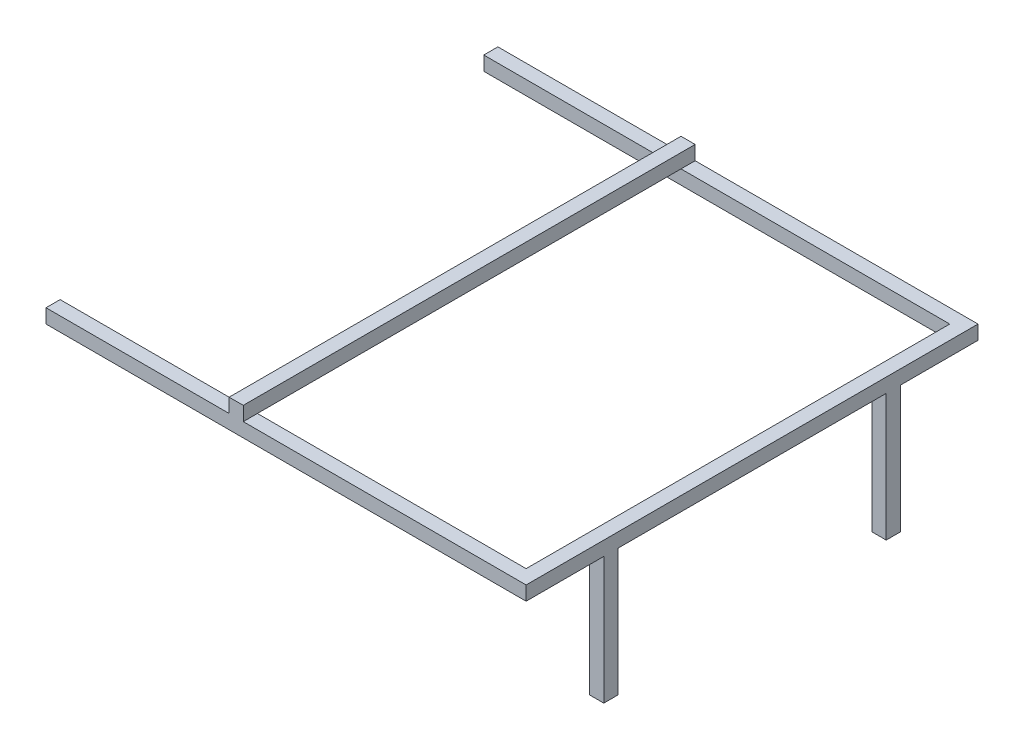
ISO-10303-21;
HEADER;
FILE_DESCRIPTION(('STEP AP214'),'2;1');
FILE_NAME('part.step','',(''),(''),'','','');
FILE_SCHEMA(('AUTOMOTIVE_DESIGN { 1 0 10303 214 1 1 1 1 }'));
ENDSEC;
DATA;
#1=APPLICATION_CONTEXT('core data for automotive mechanical design processes');
#2=APPLICATION_PROTOCOL_DEFINITION('international standard','automotive_design',2000,#1);
#3=PRODUCT_CONTEXT('',#1,'mechanical');
#4=PRODUCT('Part','Part','',(#3));
#5=PRODUCT_RELATED_PRODUCT_CATEGORY('part','',(#4));
#6=PRODUCT_DEFINITION_FORMATION('','',#4);
#7=PRODUCT_DEFINITION_CONTEXT('part definition',#1,'design');
#8=PRODUCT_DEFINITION('design','',#6,#7);
#9=PRODUCT_DEFINITION_SHAPE('','',#8);
#10=(LENGTH_UNIT() NAMED_UNIT(*) SI_UNIT(.MILLI.,.METRE.));
#11=(NAMED_UNIT(*) PLANE_ANGLE_UNIT() SI_UNIT($,.RADIAN.));
#12=(NAMED_UNIT(*) SI_UNIT($,.STERADIAN.) SOLID_ANGLE_UNIT());
#13=UNCERTAINTY_MEASURE_WITH_UNIT(LENGTH_MEASURE(1.E-05),#10,'distance_accuracy_value','');
#14=(GEOMETRIC_REPRESENTATION_CONTEXT(3) GLOBAL_UNCERTAINTY_ASSIGNED_CONTEXT((#13)) GLOBAL_UNIT_ASSIGNED_CONTEXT((#10,
#11,#12)) REPRESENTATION_CONTEXT('',''));
#15=CARTESIAN_POINT('',(0.,0.,0.));
#16=DIRECTION('',(0.,0.,1.));
#17=DIRECTION('',(1.,0.,0.));
#18=AXIS2_PLACEMENT_3D('',#15,#16,#17);
#19=CARTESIAN_POINT('',(0.,0.,0.));
#20=DIRECTION('',(0.,1.,0.));
#21=DIRECTION('',(0.,0.,1.));
#22=AXIS2_PLACEMENT_3D('',#19,#20,#21);
#23=PLANE('',#22);
#24=DIRECTION('',(-1.,0.,0.));
#25=VECTOR('',#24,1.);
#26=CARTESIAN_POINT('',(350.612129760226,0.,-17.9050493653034));
#27=LINE('',#26,#25);
#28=CARTESIAN_POINT('',(350.612129760226,0.,-17.9050493653033));
#29=VERTEX_POINT('',#28);
#30=CARTESIAN_POINT('',(330.612129760226,0.,-17.9050493653033));
#31=VERTEX_POINT('',#30);
#32=EDGE_CURVE('E65',#29,#31,#27,.T.);
#33=ORIENTED_EDGE('',*,*,#32,.F.);
#34=DIRECTION('',(0.,0.,-1.));
#35=VECTOR('',#34,1.);
#36=CARTESIAN_POINT('',(350.612129760226,0.,-147.905049365303));
#37=LINE('',#36,#35);
#38=CARTESIAN_POINT('',(350.612129760226,0.,362.094950634694));
#39=VERTEX_POINT('',#38);
#40=EDGE_CURVE('E216',#39,#29,#37,.T.);
#41=ORIENTED_EDGE('',*,*,#40,.F.);
#42=DIRECTION('',(1.,0.,0.));
#43=VECTOR('',#42,1.);
#44=CARTESIAN_POINT('',(350.612129760226,0.,362.094950634694));
#45=LINE('',#44,#43);
#46=CARTESIAN_POINT('',(330.612129760226,0.,362.094950634694));
#47=VERTEX_POINT('',#46);
#48=EDGE_CURVE('E220',#47,#39,#45,.T.);
#49=ORIENTED_EDGE('',*,*,#48,.F.);
#50=DIRECTION('',(0.,0.,-1.));
#51=VECTOR('',#50,1.);
#52=CARTESIAN_POINT('',(330.612129760226,0.,-127.905049365303));
#53=LINE('',#52,#51);
#54=EDGE_CURVE('E293',#47,#31,#53,.T.);
#55=ORIENTED_EDGE('',*,*,#54,.T.);
#56=EDGE_LOOP('',(#33,#41,#49,#55));
#57=FACE_BOUND('',#56,.T.);
#58=ADVANCED_FACE('F39',(#57),#23,.F.);
#59=DIRECTION('',(1.,0.,0.));
#60=VECTOR('',#59,1.);
#61=CARTESIAN_POINT('',(350.612129760226,0.,-37.9050493653034));
#62=LINE('',#61,#60);
#63=CARTESIAN_POINT('',(330.612129760226,0.,-37.9050493653034));
#64=VERTEX_POINT('',#63);
#65=CARTESIAN_POINT('',(350.612129760226,0.,-37.9050493653034));
#66=VERTEX_POINT('',#65);
#67=EDGE_CURVE('E211',#64,#66,#62,.T.);
#68=ORIENTED_EDGE('',*,*,#67,.F.);
#69=CARTESIAN_POINT('',(330.612129760226,0.,-127.905049365303));
#70=VERTEX_POINT('',#69);
#71=EDGE_CURVE('E282',#64,#70,#53,.T.);
#72=ORIENTED_EDGE('',*,*,#71,.T.);
#73=DIRECTION('',(1.,0.,0.));
#74=VECTOR('',#73,1.);
#75=CARTESIAN_POINT('',(-329.387870239774,0.,-127.905049365303));
#76=LINE('',#75,#74);
#77=CARTESIAN_POINT('',(-329.387870239774,0.,-127.905049365303));
#78=VERTEX_POINT('',#77);
#79=EDGE_CURVE('E322',#78,#70,#76,.T.);
#80=ORIENTED_EDGE('',*,*,#79,.F.);
#81=DIRECTION('',(0.,0.,1.));
#82=VECTOR('',#81,1.);
#83=CARTESIAN_POINT('',(-329.387870239774,0.,-147.905049365303));
#84=LINE('',#83,#82);
#85=CARTESIAN_POINT('',(-329.387870239774,0.,-147.905049365303));
#86=VERTEX_POINT('',#85);
#87=EDGE_CURVE('E299',#86,#78,#84,.T.);
#88=ORIENTED_EDGE('',*,*,#87,.F.);
#89=DIRECTION('',(-1.,0.,0.));
#90=VECTOR('',#89,1.);
#91=CARTESIAN_POINT('',(-329.387870239774,0.,-147.905049365303));
#92=LINE('',#91,#90);
#93=CARTESIAN_POINT('',(350.612129760226,0.,-147.905049365303));
#94=VERTEX_POINT('',#93);
#95=EDGE_CURVE('E304',#94,#86,#92,.T.);
#96=ORIENTED_EDGE('',*,*,#95,.F.);
#97=EDGE_CURVE('E57',#66,#94,#37,.T.);
#98=ORIENTED_EDGE('',*,*,#97,.F.);
#99=EDGE_LOOP('',(#68,#72,#80,#88,#96,#98));
#100=FACE_BOUND('',#99,.T.);
#101=ADVANCED_FACE('F424',(#100),#23,.F.);
#102=DIRECTION('',(-1.,0.,0.));
#103=VECTOR('',#102,1.);
#104=CARTESIAN_POINT('',(350.612129760226,0.,382.094950634694));
#105=LINE('',#104,#103);
#106=CARTESIAN_POINT('',(350.612129760226,0.,382.094950634694));
#107=VERTEX_POINT('',#106);
#108=CARTESIAN_POINT('',(330.612129760226,0.,382.094950634694));
#109=VERTEX_POINT('',#108);
#110=EDGE_CURVE('E217',#107,#109,#105,.T.);
#111=ORIENTED_EDGE('',*,*,#110,.F.);
#112=CARTESIAN_POINT('',(350.612129760226,0.,492.094950634697));
#113=VERTEX_POINT('',#112);
#114=EDGE_CURVE('E331',#113,#107,#37,.T.);
#115=ORIENTED_EDGE('',*,*,#114,.F.);
#116=DIRECTION('',(1.,0.,0.));
#117=VECTOR('',#116,1.);
#118=CARTESIAN_POINT('',(-329.387870239774,0.,492.094950634697));
#119=LINE('',#118,#117);
#120=CARTESIAN_POINT('',(-329.387870239774,0.,492.094950634697));
#121=VERTEX_POINT('',#120);
#122=EDGE_CURVE('E329',#121,#113,#119,.T.);
#123=ORIENTED_EDGE('',*,*,#122,.F.);
#124=DIRECTION('',(0.,0.,1.));
#125=VECTOR('',#124,1.);
#126=CARTESIAN_POINT('',(-329.387870239774,0.,472.094950634697));
#127=LINE('',#126,#125);
#128=CARTESIAN_POINT('',(-329.387870239774,0.,472.094950634697));
#129=VERTEX_POINT('',#128);
#130=EDGE_CURVE('E327',#129,#121,#127,.T.);
#131=ORIENTED_EDGE('',*,*,#130,.F.);
#132=DIRECTION('',(-1.,0.,0.));
#133=VECTOR('',#132,1.);
#134=CARTESIAN_POINT('',(-329.387870239774,0.,472.094950634697));
#135=LINE('',#134,#133);
#136=CARTESIAN_POINT('',(330.612129760226,0.,472.094950634697));
#137=VERTEX_POINT('',#136);
#138=EDGE_CURVE('E325',#137,#129,#135,.T.);
#139=ORIENTED_EDGE('',*,*,#138,.F.);
#140=EDGE_CURVE('E286',#137,#109,#53,.T.);
#141=ORIENTED_EDGE('',*,*,#140,.T.);
#142=EDGE_LOOP('',(#111,#115,#123,#131,#139,#141));
#143=FACE_BOUND('',#142,.T.);
#144=ADVANCED_FACE('F426',(#143),#23,.F.);
#145=CARTESIAN_POINT('',(-70.0005686119825,20.,-127.905049365303));
#146=DIRECTION('',(1.,0.,0.));
#147=DIRECTION('',(0.,0.,-1.));
#148=AXIS2_PLACEMENT_3D('',#145,#146,#147);
#149=PLANE('',#148);
#150=DIRECTION('',(0.,0.,-1.));
#151=VECTOR('',#150,1.);
#152=CARTESIAN_POINT('',(-70.0005686119825,20.,472.094950634697));
#153=LINE('',#152,#151);
#154=CARTESIAN_POINT('',(-70.0005686119825,20.,472.094950634697));
#155=VERTEX_POINT('',#154);
#156=CARTESIAN_POINT('',(-70.0005686119825,20.,-127.905049365303));
#157=VERTEX_POINT('',#156);
#158=EDGE_CURVE('E248',#155,#157,#153,.T.);
#159=ORIENTED_EDGE('',*,*,#158,.F.);
#160=DIRECTION('',(0.,0.,1.));
#161=VECTOR('',#160,1.);
#162=CARTESIAN_POINT('',(-70.0005686119825,20.,-147.905049365303));
#163=LINE('',#162,#161);
#164=CARTESIAN_POINT('',(-70.0005686119825,20.,492.094950634697));
#165=VERTEX_POINT('',#164);
#166=EDGE_CURVE('E48',#155,#165,#163,.T.);
#167=ORIENTED_EDGE('',*,*,#166,.T.);
#168=DIRECTION('',(0.,-1.,0.));
#169=VECTOR('',#168,1.);
#170=CARTESIAN_POINT('',(-70.0005686119825,40.,492.094950634697));
#171=LINE('',#170,#169);
#172=CARTESIAN_POINT('',(-70.0005686119825,40.,492.094950634697));
#173=VERTEX_POINT('',#172);
#174=EDGE_CURVE('E276',#173,#165,#171,.T.);
#175=ORIENTED_EDGE('',*,*,#174,.F.);
#176=DIRECTION('',(0.,0.,1.));
#177=VECTOR('',#176,1.);
#178=CARTESIAN_POINT('',(-70.0005686119825,40.,-147.905049365303));
#179=LINE('',#178,#177);
#180=CARTESIAN_POINT('',(-70.0005686119825,40.,-147.905049365303));
#181=VERTEX_POINT('',#180);
#182=EDGE_CURVE('E261',#181,#173,#179,.T.);
#183=ORIENTED_EDGE('',*,*,#182,.F.);
#184=DIRECTION('',(0.,-1.,0.));
#185=VECTOR('',#184,1.);
#186=CARTESIAN_POINT('',(-70.0005686119825,40.,-147.905049365303));
#187=LINE('',#186,#185);
#188=CARTESIAN_POINT('',(-70.0005686119825,20.,-147.905049365303));
#189=VERTEX_POINT('',#188);
#190=EDGE_CURVE('E279',#181,#189,#187,.T.);
#191=ORIENTED_EDGE('',*,*,#190,.T.);
#192=EDGE_CURVE('E257',#189,#157,#163,.T.);
#193=ORIENTED_EDGE('',*,*,#192,.T.);
#194=EDGE_LOOP('',(#159,#167,#175,#183,#191,#193));
#195=FACE_BOUND('',#194,.T.);
#196=ADVANCED_FACE('F358',(#195),#149,.F.);
#197=CARTESIAN_POINT('',(-50.0005686119826,20.,-127.905049365303));
#198=DIRECTION('',(1.,0.,0.));
#199=DIRECTION('',(0.,0.,-1.));
#200=AXIS2_PLACEMENT_3D('',#197,#198,#199);
#201=PLANE('',#200);
#202=DIRECTION('',(0.,0.,-1.));
#203=VECTOR('',#202,1.);
#204=CARTESIAN_POINT('',(-50.0005686119826,20.,-147.905049365303));
#205=LINE('',#204,#203);
#206=CARTESIAN_POINT('',(-50.0005686119826,20.,492.094950634697));
#207=VERTEX_POINT('',#206);
#208=CARTESIAN_POINT('',(-50.0005686119826,20.,472.094950634697));
#209=VERTEX_POINT('',#208);
#210=EDGE_CURVE('E50',#207,#209,#205,.T.);
#211=ORIENTED_EDGE('',*,*,#210,.T.);
#212=DIRECTION('',(0.,0.,1.));
#213=VECTOR('',#212,1.);
#214=CARTESIAN_POINT('',(-50.0005686119826,20.,472.094950634697));
#215=LINE('',#214,#213);
#216=CARTESIAN_POINT('',(-50.0005686119826,20.,-127.905049365303));
#217=VERTEX_POINT('',#216);
#218=EDGE_CURVE('E253',#217,#209,#215,.T.);
#219=ORIENTED_EDGE('',*,*,#218,.F.);
#220=CARTESIAN_POINT('',(-50.0005686119826,20.,-147.905049365303));
#221=VERTEX_POINT('',#220);
#222=EDGE_CURVE('E11',#217,#221,#205,.T.);
#223=ORIENTED_EDGE('',*,*,#222,.T.);
#224=DIRECTION('',(0.,-1.,0.));
#225=VECTOR('',#224,1.);
#226=CARTESIAN_POINT('',(-50.0005686119826,40.,-147.905049365303));
#227=LINE('',#226,#225);
#228=CARTESIAN_POINT('',(-50.0005686119826,40.,-147.905049365303));
#229=VERTEX_POINT('',#228);
#230=EDGE_CURVE('E267',#229,#221,#227,.T.);
#231=ORIENTED_EDGE('',*,*,#230,.F.);
#232=DIRECTION('',(0.,0.,-1.));
#233=VECTOR('',#232,1.);
#234=CARTESIAN_POINT('',(-50.0005686119826,40.,-147.905049365303));
#235=LINE('',#234,#233);
#236=CARTESIAN_POINT('',(-50.0005686119826,40.,492.094950634697));
#237=VERTEX_POINT('',#236);
#238=EDGE_CURVE('E265',#237,#229,#235,.T.);
#239=ORIENTED_EDGE('',*,*,#238,.F.);
#240=DIRECTION('',(0.,-1.,0.));
#241=VECTOR('',#240,1.);
#242=CARTESIAN_POINT('',(-50.0005686119826,40.,492.094950634697));
#243=LINE('',#242,#241);
#244=EDGE_CURVE('E273',#237,#207,#243,.T.);
#245=ORIENTED_EDGE('',*,*,#244,.T.);
#246=EDGE_LOOP('',(#211,#219,#223,#231,#239,#245));
#247=FACE_BOUND('',#246,.T.);
#248=ADVANCED_FACE('F395',(#247),#201,.T.);
#249=CARTESIAN_POINT('',(0.,20.,0.));
#250=DIRECTION('',(0.,1.,0.));
#251=DIRECTION('',(0.,0.,1.));
#252=AXIS2_PLACEMENT_3D('',#249,#250,#251);
#253=PLANE('',#252);
#254=ORIENTED_EDGE('',*,*,#210,.F.);
#255=DIRECTION('',(1.,0.,0.));
#256=VECTOR('',#255,1.);
#257=CARTESIAN_POINT('',(-329.387870239774,20.,492.094950634697));
#258=LINE('',#257,#256);
#259=CARTESIAN_POINT('',(350.612129760226,20.,492.094950634697));
#260=VERTEX_POINT('',#259);
#261=EDGE_CURVE('E311',#207,#260,#258,.T.);
#262=ORIENTED_EDGE('',*,*,#261,.T.);
#263=DIRECTION('',(0.,0.,-1.));
#264=VECTOR('',#263,1.);
#265=CARTESIAN_POINT('',(350.612129760226,20.,-147.905049365303));
#266=LINE('',#265,#264);
#267=CARTESIAN_POINT('',(350.612129760226,20.,-147.905049365303));
#268=VERTEX_POINT('',#267);
#269=EDGE_CURVE('E314',#260,#268,#266,.T.);
#270=ORIENTED_EDGE('',*,*,#269,.T.);
#271=DIRECTION('',(-1.,0.,0.));
#272=VECTOR('',#271,1.);
#273=CARTESIAN_POINT('',(-329.387870239774,20.,-147.905049365303));
#274=LINE('',#273,#272);
#275=EDGE_CURVE('E317',#268,#221,#274,.T.);
#276=ORIENTED_EDGE('',*,*,#275,.T.);
#277=ORIENTED_EDGE('',*,*,#222,.F.);
#278=DIRECTION('',(-1.,0.,0.));
#279=VECTOR('',#278,1.);
#280=CARTESIAN_POINT('',(-50.0005686119826,20.,-127.905049365303));
#281=LINE('',#280,#279);
#282=CARTESIAN_POINT('',(330.612129760226,20.,-127.905049365303));
#283=VERTEX_POINT('',#282);
#284=EDGE_CURVE('E288',#283,#217,#281,.T.);
#285=ORIENTED_EDGE('',*,*,#284,.F.);
#286=DIRECTION('',(0.,0.,-1.));
#287=VECTOR('',#286,1.);
#288=CARTESIAN_POINT('',(330.612129760226,20.,-127.905049365303));
#289=LINE('',#288,#287);
#290=CARTESIAN_POINT('',(330.612129760226,20.,472.094950634697));
#291=VERTEX_POINT('',#290);
#292=EDGE_CURVE('E285',#291,#283,#289,.T.);
#293=ORIENTED_EDGE('',*,*,#292,.F.);
#294=DIRECTION('',(1.,0.,0.));
#295=VECTOR('',#294,1.);
#296=CARTESIAN_POINT('',(-50.0005686119825,20.,472.094950634697));
#297=LINE('',#296,#295);
#298=EDGE_CURVE('E283',#209,#291,#297,.T.);
#299=ORIENTED_EDGE('',*,*,#298,.F.);
#300=EDGE_LOOP('',(#254,#262,#270,#276,#277,#285,#293,#299));
#301=FACE_BOUND('',#300,.T.);
#302=ADVANCED_FACE('F393',(#301),#253,.T.);
#303=ORIENTED_EDGE('',*,*,#192,.F.);
#304=CARTESIAN_POINT('',(-329.387870239774,20.,-147.905049365303));
#305=VERTEX_POINT('',#304);
#306=EDGE_CURVE('E316',#189,#305,#274,.T.);
#307=ORIENTED_EDGE('',*,*,#306,.T.);
#308=DIRECTION('',(0.,0.,1.));
#309=VECTOR('',#308,1.);
#310=CARTESIAN_POINT('',(-329.387870239774,20.,-147.905049365303));
#311=LINE('',#310,#309);
#312=CARTESIAN_POINT('',(-329.387870239774,20.,-127.905049365303));
#313=VERTEX_POINT('',#312);
#314=EDGE_CURVE('E300',#305,#313,#311,.T.);
#315=ORIENTED_EDGE('',*,*,#314,.T.);
#316=DIRECTION('',(1.,0.,0.));
#317=VECTOR('',#316,1.);
#318=CARTESIAN_POINT('',(-329.387870239774,20.,-127.905049365303));
#319=LINE('',#318,#317);
#320=EDGE_CURVE('E303',#313,#157,#319,.T.);
#321=ORIENTED_EDGE('',*,*,#320,.T.);
#322=EDGE_LOOP('',(#303,#307,#315,#321));
#323=FACE_BOUND('',#322,.T.);
#324=ADVANCED_FACE('F379',(#323),#253,.T.);
#325=ORIENTED_EDGE('',*,*,#166,.F.);
#326=DIRECTION('',(-1.,0.,0.));
#327=VECTOR('',#326,1.);
#328=CARTESIAN_POINT('',(-329.387870239774,20.,472.094950634697));
#329=LINE('',#328,#327);
#330=CARTESIAN_POINT('',(-329.387870239774,20.,472.094950634697));
#331=VERTEX_POINT('',#330);
#332=EDGE_CURVE('E307',#155,#331,#329,.T.);
#333=ORIENTED_EDGE('',*,*,#332,.T.);
#334=DIRECTION('',(0.,0.,1.));
#335=VECTOR('',#334,1.);
#336=CARTESIAN_POINT('',(-329.387870239774,20.,472.094950634697));
#337=LINE('',#336,#335);
#338=CARTESIAN_POINT('',(-329.387870239774,20.,492.094950634697));
#339=VERTEX_POINT('',#338);
#340=EDGE_CURVE('E309',#331,#339,#337,.T.);
#341=ORIENTED_EDGE('',*,*,#340,.T.);
#342=EDGE_CURVE('E312',#339,#165,#258,.T.);
#343=ORIENTED_EDGE('',*,*,#342,.T.);
#344=EDGE_LOOP('',(#325,#333,#341,#343));
#345=FACE_BOUND('',#344,.T.);
#346=ADVANCED_FACE('F458',(#345),#253,.T.);
#347=CARTESIAN_POINT('',(-329.387870239774,20.,-147.905049365303));
#348=DIRECTION('',(1.,0.,0.));
#349=DIRECTION('',(0.,0.,-1.));
#350=AXIS2_PLACEMENT_3D('',#347,#348,#349);
#351=PLANE('',#350);
#352=ORIENTED_EDGE('',*,*,#87,.T.);
#353=DIRECTION('',(0.,-1.,0.));
#354=VECTOR('',#353,1.);
#355=CARTESIAN_POINT('',(-329.387870239774,20.,-127.905049365303));
#356=LINE('',#355,#354);
#357=EDGE_CURVE('E43',#313,#78,#356,.T.);
#358=ORIENTED_EDGE('',*,*,#357,.F.);
#359=ORIENTED_EDGE('',*,*,#314,.F.);
#360=DIRECTION('',(0.,-1.,0.));
#361=VECTOR('',#360,1.);
#362=CARTESIAN_POINT('',(-329.387870239774,20.,-147.905049365303));
#363=LINE('',#362,#361);
#364=EDGE_CURVE('E319',#305,#86,#363,.T.);
#365=ORIENTED_EDGE('',*,*,#364,.T.);
#366=EDGE_LOOP('',(#352,#358,#359,#365));
#367=FACE_BOUND('',#366,.T.);
#368=ADVANCED_FACE('F41',(#367),#351,.F.);
#369=CARTESIAN_POINT('',(-329.387870239774,20.,-127.905049365303));
#370=DIRECTION('',(0.,0.,-1.));
#371=DIRECTION('',(-1.,0.,0.));
#372=AXIS2_PLACEMENT_3D('',#369,#370,#371);
#373=PLANE('',#372);
#374=ORIENTED_EDGE('',*,*,#79,.T.);
#375=DIRECTION('',(0.,-1.,0.));
#376=VECTOR('',#375,1.);
#377=CARTESIAN_POINT('',(330.612129760226,20.,-127.905049365303));
#378=LINE('',#377,#376);
#379=EDGE_CURVE('E291',#283,#70,#378,.T.);
#380=ORIENTED_EDGE('',*,*,#379,.F.);
#381=ORIENTED_EDGE('',*,*,#284,.T.);
#382=DIRECTION('',(1.,0.,0.));
#383=VECTOR('',#382,1.);
#384=CARTESIAN_POINT('',(-70.0005686119825,20.,-127.905049365303));
#385=LINE('',#384,#383);
#386=EDGE_CURVE('E251',#157,#217,#385,.T.);
#387=ORIENTED_EDGE('',*,*,#386,.F.);
#388=ORIENTED_EDGE('',*,*,#320,.F.);
#389=ORIENTED_EDGE('',*,*,#357,.T.);
#390=EDGE_LOOP('',(#374,#380,#381,#387,#388,#389));
#391=FACE_BOUND('',#390,.T.);
#392=ADVANCED_FACE('F380',(#391),#373,.F.);
#393=CARTESIAN_POINT('',(-329.387870239774,20.,472.094950634697));
#394=DIRECTION('',(0.,0.,1.));
#395=DIRECTION('',(1.,0.,0.));
#396=AXIS2_PLACEMENT_3D('',#393,#394,#395);
#397=PLANE('',#396);
#398=ORIENTED_EDGE('',*,*,#138,.T.);
#399=DIRECTION('',(0.,-1.,0.));
#400=VECTOR('',#399,1.);
#401=CARTESIAN_POINT('',(-329.387870239774,20.,472.094950634697));
#402=LINE('',#401,#400);
#403=EDGE_CURVE('E344',#331,#129,#402,.T.);
#404=ORIENTED_EDGE('',*,*,#403,.F.);
#405=ORIENTED_EDGE('',*,*,#332,.F.);
#406=DIRECTION('',(-1.,0.,0.));
#407=VECTOR('',#406,1.);
#408=CARTESIAN_POINT('',(-70.0005686119825,20.,472.094950634697));
#409=LINE('',#408,#407);
#410=EDGE_CURVE('E255',#209,#155,#409,.T.);
#411=ORIENTED_EDGE('',*,*,#410,.F.);
#412=ORIENTED_EDGE('',*,*,#298,.T.);
#413=DIRECTION('',(0.,-1.,0.));
#414=VECTOR('',#413,1.);
#415=CARTESIAN_POINT('',(330.612129760226,20.,472.094950634697));
#416=LINE('',#415,#414);
#417=EDGE_CURVE('E296',#291,#137,#416,.T.);
#418=ORIENTED_EDGE('',*,*,#417,.T.);
#419=EDGE_LOOP('',(#398,#404,#405,#411,#412,#418));
#420=FACE_BOUND('',#419,.T.);
#421=ADVANCED_FACE('F389',(#420),#397,.F.);
#422=CARTESIAN_POINT('',(-329.387870239774,20.,472.094950634697));
#423=DIRECTION('',(1.,0.,0.));
#424=DIRECTION('',(0.,0.,-1.));
#425=AXIS2_PLACEMENT_3D('',#422,#423,#424);
#426=PLANE('',#425);
#427=ORIENTED_EDGE('',*,*,#130,.T.);
#428=DIRECTION('',(0.,-1.,0.));
#429=VECTOR('',#428,1.);
#430=CARTESIAN_POINT('',(-329.387870239774,20.,492.094950634697));
#431=LINE('',#430,#429);
#432=EDGE_CURVE('E342',#339,#121,#431,.T.);
#433=ORIENTED_EDGE('',*,*,#432,.F.);
#434=ORIENTED_EDGE('',*,*,#340,.F.);
#435=ORIENTED_EDGE('',*,*,#403,.T.);
#436=EDGE_LOOP('',(#427,#433,#434,#435));
#437=FACE_BOUND('',#436,.T.);
#438=ADVANCED_FACE('F457',(#437),#426,.F.);
#439=CARTESIAN_POINT('',(-329.387870239774,20.,492.094950634697));
#440=DIRECTION('',(0.,0.,-1.));
#441=DIRECTION('',(-1.,0.,0.));
#442=AXIS2_PLACEMENT_3D('',#439,#440,#441);
#443=PLANE('',#442);
#444=ORIENTED_EDGE('',*,*,#122,.T.);
#445=DIRECTION('',(0.,-1.,0.));
#446=VECTOR('',#445,1.);
#447=CARTESIAN_POINT('',(350.612129760226,20.,492.094950634697));
#448=LINE('',#447,#446);
#449=EDGE_CURVE('E339',#260,#113,#448,.T.);
#450=ORIENTED_EDGE('',*,*,#449,.F.);
#451=ORIENTED_EDGE('',*,*,#261,.F.);
#452=ORIENTED_EDGE('',*,*,#244,.F.);
#453=DIRECTION('',(1.,0.,0.));
#454=VECTOR('',#453,1.);
#455=CARTESIAN_POINT('',(-70.0005686119825,40.,492.094950634697));
#456=LINE('',#455,#454);
#457=EDGE_CURVE('E263',#173,#237,#456,.T.);
#458=ORIENTED_EDGE('',*,*,#457,.F.);
#459=ORIENTED_EDGE('',*,*,#174,.T.);
#460=ORIENTED_EDGE('',*,*,#342,.F.);
#461=ORIENTED_EDGE('',*,*,#432,.T.);
#462=EDGE_LOOP('',(#444,#450,#451,#452,#458,#459,#460,#461));
#463=FACE_BOUND('',#462,.T.);
#464=ADVANCED_FACE('F364',(#463),#443,.F.);
#465=CARTESIAN_POINT('',(350.612129760226,20.,-147.905049365303));
#466=DIRECTION('',(-1.,0.,0.));
#467=DIRECTION('',(0.,0.,1.));
#468=AXIS2_PLACEMENT_3D('',#465,#466,#467);
#469=PLANE('',#468);
#470=ORIENTED_EDGE('',*,*,#114,.T.);
#471=DIRECTION('',(0.,1.,0.));
#472=VECTOR('',#471,1.);
#473=CARTESIAN_POINT('',(350.612129760226,-180.,382.094950634694));
#474=LINE('',#473,#472);
#475=CARTESIAN_POINT('',(350.612129760226,-180.,382.094950634694));
#476=VERTEX_POINT('',#475);
#477=EDGE_CURVE('E245',#476,#107,#474,.T.);
#478=ORIENTED_EDGE('',*,*,#477,.F.);
#479=DIRECTION('',(0.,0.,1.));
#480=VECTOR('',#479,1.);
#481=CARTESIAN_POINT('',(350.612129760226,-180.,382.094950634694));
#482=LINE('',#481,#480);
#483=CARTESIAN_POINT('',(350.612129760226,-180.,362.094950634694));
#484=VERTEX_POINT('',#483);
#485=EDGE_CURVE('E226',#484,#476,#482,.T.);
#486=ORIENTED_EDGE('',*,*,#485,.F.);
#487=DIRECTION('',(0.,1.,0.));
#488=VECTOR('',#487,1.);
#489=CARTESIAN_POINT('',(350.612129760226,-180.,362.094950634694));
#490=LINE('',#489,#488);
#491=EDGE_CURVE('E234',#484,#39,#490,.T.);
#492=ORIENTED_EDGE('',*,*,#491,.T.);
#493=ORIENTED_EDGE('',*,*,#40,.T.);
#494=DIRECTION('',(0.,1.,0.));
#495=VECTOR('',#494,1.);
#496=CARTESIAN_POINT('',(350.612129760226,-180.,-17.9050493653034));
#497=LINE('',#496,#495);
#498=CARTESIAN_POINT('',(350.612129760226,-180.,-17.9050493653034));
#499=VERTEX_POINT('',#498);
#500=EDGE_CURVE('E196',#499,#29,#497,.T.);
#501=ORIENTED_EDGE('',*,*,#500,.F.);
#502=DIRECTION('',(0.,0.,1.));
#503=VECTOR('',#502,1.);
#504=CARTESIAN_POINT('',(350.612129760226,-180.,-37.9050493653034));
#505=LINE('',#504,#503);
#506=CARTESIAN_POINT('',(350.612129760226,-180.,-37.9050493653034));
#507=VERTEX_POINT('',#506);
#508=EDGE_CURVE('E202',#507,#499,#505,.T.);
#509=ORIENTED_EDGE('',*,*,#508,.F.);
#510=DIRECTION('',(0.,1.,0.));
#511=VECTOR('',#510,1.);
#512=CARTESIAN_POINT('',(350.612129760226,-180.,-37.9050493653034));
#513=LINE('',#512,#511);
#514=EDGE_CURVE('E401',#507,#66,#513,.T.);
#515=ORIENTED_EDGE('',*,*,#514,.T.);
#516=ORIENTED_EDGE('',*,*,#97,.T.);
#517=DIRECTION('',(0.,-1.,0.));
#518=VECTOR('',#517,1.);
#519=CARTESIAN_POINT('',(350.612129760226,20.,-147.905049365303));
#520=LINE('',#519,#518);
#521=EDGE_CURVE('E336',#268,#94,#520,.T.);
#522=ORIENTED_EDGE('',*,*,#521,.F.);
#523=ORIENTED_EDGE('',*,*,#269,.F.);
#524=ORIENTED_EDGE('',*,*,#449,.T.);
#525=EDGE_LOOP('',(#470,#478,#486,#492,#493,#501,#509,#515,#516,#522,#523,#524));
#526=FACE_BOUND('',#525,.T.);
#527=ADVANCED_FACE('F214',(#526),#469,.F.);
#528=CARTESIAN_POINT('',(-329.387870239774,20.,-147.905049365303));
#529=DIRECTION('',(0.,0.,1.));
#530=DIRECTION('',(1.,0.,0.));
#531=AXIS2_PLACEMENT_3D('',#528,#529,#530);
#532=PLANE('',#531);
#533=ORIENTED_EDGE('',*,*,#95,.T.);
#534=ORIENTED_EDGE('',*,*,#364,.F.);
#535=ORIENTED_EDGE('',*,*,#306,.F.);
#536=ORIENTED_EDGE('',*,*,#190,.F.);
#537=DIRECTION('',(-1.,0.,0.));
#538=VECTOR('',#537,1.);
#539=CARTESIAN_POINT('',(-70.0005686119825,40.,-147.905049365303));
#540=LINE('',#539,#538);
#541=EDGE_CURVE('E258',#229,#181,#540,.T.);
#542=ORIENTED_EDGE('',*,*,#541,.F.);
#543=ORIENTED_EDGE('',*,*,#230,.T.);
#544=ORIENTED_EDGE('',*,*,#275,.F.);
#545=ORIENTED_EDGE('',*,*,#521,.T.);
#546=EDGE_LOOP('',(#533,#534,#535,#536,#542,#543,#544,#545));
#547=FACE_BOUND('',#546,.T.);
#548=ADVANCED_FACE('F375',(#547),#532,.F.);
#549=CARTESIAN_POINT('',(330.612129760226,20.,-127.905049365303));
#550=DIRECTION('',(-1.,0.,0.));
#551=DIRECTION('',(0.,0.,1.));
#552=AXIS2_PLACEMENT_3D('',#549,#550,#551);
#553=PLANE('',#552);
#554=ORIENTED_EDGE('',*,*,#140,.F.);
#555=ORIENTED_EDGE('',*,*,#417,.F.);
#556=ORIENTED_EDGE('',*,*,#292,.T.);
#557=ORIENTED_EDGE('',*,*,#379,.T.);
#558=ORIENTED_EDGE('',*,*,#71,.F.);
#559=DIRECTION('',(0.,1.,0.));
#560=VECTOR('',#559,1.);
#561=CARTESIAN_POINT('',(330.612129760226,-180.,-37.9050493653034));
#562=LINE('',#561,#560);
#563=CARTESIAN_POINT('',(330.612129760226,-180.,-37.9050493653034));
#564=VERTEX_POINT('',#563);
#565=EDGE_CURVE('E222',#564,#64,#562,.T.);
#566=ORIENTED_EDGE('',*,*,#565,.F.);
#567=DIRECTION('',(0.,0.,-1.));
#568=VECTOR('',#567,1.);
#569=CARTESIAN_POINT('',(330.612129760226,-180.,-37.9050493653034));
#570=LINE('',#569,#568);
#571=CARTESIAN_POINT('',(330.612129760226,-180.,-17.9050493653033));
#572=VERTEX_POINT('',#571);
#573=EDGE_CURVE('E201',#572,#564,#570,.T.);
#574=ORIENTED_EDGE('',*,*,#573,.F.);
#575=DIRECTION('',(0.,1.,0.));
#576=VECTOR('',#575,1.);
#577=CARTESIAN_POINT('',(330.612129760226,-180.,-17.9050493653033));
#578=LINE('',#577,#576);
#579=EDGE_CURVE('E198',#572,#31,#578,.T.);
#580=ORIENTED_EDGE('',*,*,#579,.T.);
#581=ORIENTED_EDGE('',*,*,#54,.F.);
#582=DIRECTION('',(0.,1.,0.));
#583=VECTOR('',#582,1.);
#584=CARTESIAN_POINT('',(330.612129760226,-180.,362.094950634694));
#585=LINE('',#584,#583);
#586=CARTESIAN_POINT('',(330.612129760226,-180.,362.094950634694));
#587=VERTEX_POINT('',#586);
#588=EDGE_CURVE('E239',#587,#47,#585,.T.);
#589=ORIENTED_EDGE('',*,*,#588,.F.);
#590=DIRECTION('',(0.,0.,-1.));
#591=VECTOR('',#590,1.);
#592=CARTESIAN_POINT('',(330.612129760226,-180.,382.094950634694));
#593=LINE('',#592,#591);
#594=CARTESIAN_POINT('',(330.612129760226,-180.,382.094950634694));
#595=VERTEX_POINT('',#594);
#596=EDGE_CURVE('E231',#595,#587,#593,.T.);
#597=ORIENTED_EDGE('',*,*,#596,.F.);
#598=DIRECTION('',(0.,1.,0.));
#599=VECTOR('',#598,1.);
#600=CARTESIAN_POINT('',(330.612129760226,-180.,382.094950634694));
#601=LINE('',#600,#599);
#602=EDGE_CURVE('E242',#595,#109,#601,.T.);
#603=ORIENTED_EDGE('',*,*,#602,.T.);
#604=EDGE_LOOP('',(#554,#555,#556,#557,#558,#566,#574,#580,#581,#589,#597,#603));
#605=FACE_BOUND('',#604,.T.);
#606=ADVANCED_FACE('F412',(#605),#553,.T.);
#607=CARTESIAN_POINT('',(0.,40.,0.));
#608=DIRECTION('',(0.,-1.,0.));
#609=DIRECTION('',(0.,0.,-1.));
#610=AXIS2_PLACEMENT_3D('',#607,#608,#609);
#611=PLANE('',#610);
#612=ORIENTED_EDGE('',*,*,#541,.T.);
#613=ORIENTED_EDGE('',*,*,#182,.T.);
#614=ORIENTED_EDGE('',*,*,#457,.T.);
#615=ORIENTED_EDGE('',*,*,#238,.T.);
#616=EDGE_LOOP('',(#612,#613,#614,#615));
#617=FACE_BOUND('',#616,.T.);
#618=ADVANCED_FACE('F369',(#617),#611,.F.);
#619=CARTESIAN_POINT('',(0.,20.,0.));
#620=DIRECTION('',(0.,-1.,0.));
#621=DIRECTION('',(0.,0.,-1.));
#622=AXIS2_PLACEMENT_3D('',#619,#620,#621);
#623=PLANE('',#622);
#624=ORIENTED_EDGE('',*,*,#158,.T.);
#625=ORIENTED_EDGE('',*,*,#386,.T.);
#626=ORIENTED_EDGE('',*,*,#218,.T.);
#627=ORIENTED_EDGE('',*,*,#410,.T.);
#628=EDGE_LOOP('',(#624,#625,#626,#627));
#629=FACE_BOUND('',#628,.T.);
#630=ADVANCED_FACE('F385',(#629),#623,.T.);
#631=CARTESIAN_POINT('',(350.612129760226,-180.,382.094950634694));
#632=DIRECTION('',(0.,0.,-1.));
#633=DIRECTION('',(-1.,0.,0.));
#634=AXIS2_PLACEMENT_3D('',#631,#632,#633);
#635=PLANE('',#634);
#636=ORIENTED_EDGE('',*,*,#110,.T.);
#637=ORIENTED_EDGE('',*,*,#602,.F.);
#638=DIRECTION('',(-1.,0.,0.));
#639=VECTOR('',#638,1.);
#640=CARTESIAN_POINT('',(350.612129760226,-180.,382.094950634694));
#641=LINE('',#640,#639);
#642=EDGE_CURVE('E229',#476,#595,#641,.T.);
#643=ORIENTED_EDGE('',*,*,#642,.F.);
#644=ORIENTED_EDGE('',*,*,#477,.T.);
#645=EDGE_LOOP('',(#636,#637,#643,#644));
#646=FACE_BOUND('',#645,.T.);
#647=ADVANCED_FACE('F446',(#646),#635,.F.);
#648=CARTESIAN_POINT('',(350.612129760226,-180.,362.094950634694));
#649=DIRECTION('',(0.,0.,1.));
#650=DIRECTION('',(1.,0.,0.));
#651=AXIS2_PLACEMENT_3D('',#648,#649,#650);
#652=PLANE('',#651);
#653=ORIENTED_EDGE('',*,*,#48,.T.);
#654=ORIENTED_EDGE('',*,*,#491,.F.);
#655=DIRECTION('',(1.,0.,0.));
#656=VECTOR('',#655,1.);
#657=CARTESIAN_POINT('',(350.612129760226,-180.,362.094950634694));
#658=LINE('',#657,#656);
#659=EDGE_CURVE('E233',#587,#484,#658,.T.);
#660=ORIENTED_EDGE('',*,*,#659,.F.);
#661=ORIENTED_EDGE('',*,*,#588,.T.);
#662=EDGE_LOOP('',(#653,#654,#660,#661));
#663=FACE_BOUND('',#662,.T.);
#664=ADVANCED_FACE('F452',(#663),#652,.F.);
#665=CARTESIAN_POINT('',(0.,-180.,0.));
#666=DIRECTION('',(0.,1.,0.));
#667=DIRECTION('',(0.,0.,1.));
#668=AXIS2_PLACEMENT_3D('',#665,#666,#667);
#669=PLANE('',#668);
#670=ORIENTED_EDGE('',*,*,#485,.T.);
#671=ORIENTED_EDGE('',*,*,#642,.T.);
#672=ORIENTED_EDGE('',*,*,#596,.T.);
#673=ORIENTED_EDGE('',*,*,#659,.T.);
#674=EDGE_LOOP('',(#670,#671,#672,#673));
#675=FACE_BOUND('',#674,.T.);
#676=ADVANCED_FACE('F421',(#675),#669,.F.);
#677=CARTESIAN_POINT('',(350.612129760226,-180.,-17.9050493653034));
#678=DIRECTION('',(0.,0.,-1.));
#679=DIRECTION('',(-1.,0.,0.));
#680=AXIS2_PLACEMENT_3D('',#677,#678,#679);
#681=PLANE('',#680);
#682=ORIENTED_EDGE('',*,*,#32,.T.);
#683=ORIENTED_EDGE('',*,*,#579,.F.);
#684=DIRECTION('',(-1.,0.,0.));
#685=VECTOR('',#684,1.);
#686=CARTESIAN_POINT('',(350.612129760226,-180.,-17.9050493653034));
#687=LINE('',#686,#685);
#688=EDGE_CURVE('E192',#499,#572,#687,.T.);
#689=ORIENTED_EDGE('',*,*,#688,.F.);
#690=ORIENTED_EDGE('',*,*,#500,.T.);
#691=EDGE_LOOP('',(#682,#683,#689,#690));
#692=FACE_BOUND('',#691,.T.);
#693=ADVANCED_FACE('F194',(#692),#681,.F.);
#694=CARTESIAN_POINT('',(350.612129760226,-180.,-37.9050493653034));
#695=DIRECTION('',(0.,0.,1.));
#696=DIRECTION('',(1.,0.,0.));
#697=AXIS2_PLACEMENT_3D('',#694,#695,#696);
#698=PLANE('',#697);
#699=ORIENTED_EDGE('',*,*,#67,.T.);
#700=ORIENTED_EDGE('',*,*,#514,.F.);
#701=DIRECTION('',(1.,0.,0.));
#702=VECTOR('',#701,1.);
#703=CARTESIAN_POINT('',(350.612129760226,-180.,-37.9050493653034));
#704=LINE('',#703,#702);
#705=EDGE_CURVE('E207',#564,#507,#704,.T.);
#706=ORIENTED_EDGE('',*,*,#705,.F.);
#707=ORIENTED_EDGE('',*,*,#565,.T.);
#708=EDGE_LOOP('',(#699,#700,#706,#707));
#709=FACE_BOUND('',#708,.T.);
#710=ADVANCED_FACE('F413',(#709),#698,.F.);
#711=CARTESIAN_POINT('',(0.,-180.,0.));
#712=DIRECTION('',(0.,-1.,0.));
#713=DIRECTION('',(0.,0.,-1.));
#714=AXIS2_PLACEMENT_3D('',#711,#712,#713);
#715=PLANE('',#714);
#716=ORIENTED_EDGE('',*,*,#508,.T.);
#717=ORIENTED_EDGE('',*,*,#688,.T.);
#718=ORIENTED_EDGE('',*,*,#573,.T.);
#719=ORIENTED_EDGE('',*,*,#705,.T.);
#720=EDGE_LOOP('',(#716,#717,#718,#719));
#721=FACE_BOUND('',#720,.T.);
#722=ADVANCED_FACE('F205',(#721),#715,.T.);
#723=CLOSED_SHELL('',(#58,#101,#144,#196,#248,#302,#324,#346,#368,#392,#421,#438,#464,#527,#548,
#606,#618,#630,#647,#664,#676,#693,#710,#722));
#724=MANIFOLD_SOLID_BREP('B2',#723);
#725=ADVANCED_BREP_SHAPE_REPRESENTATION('',(#18,#724),#14);
#726=SHAPE_DEFINITION_REPRESENTATION(#9,#725);
ENDSEC;
END-ISO-10303-21;
